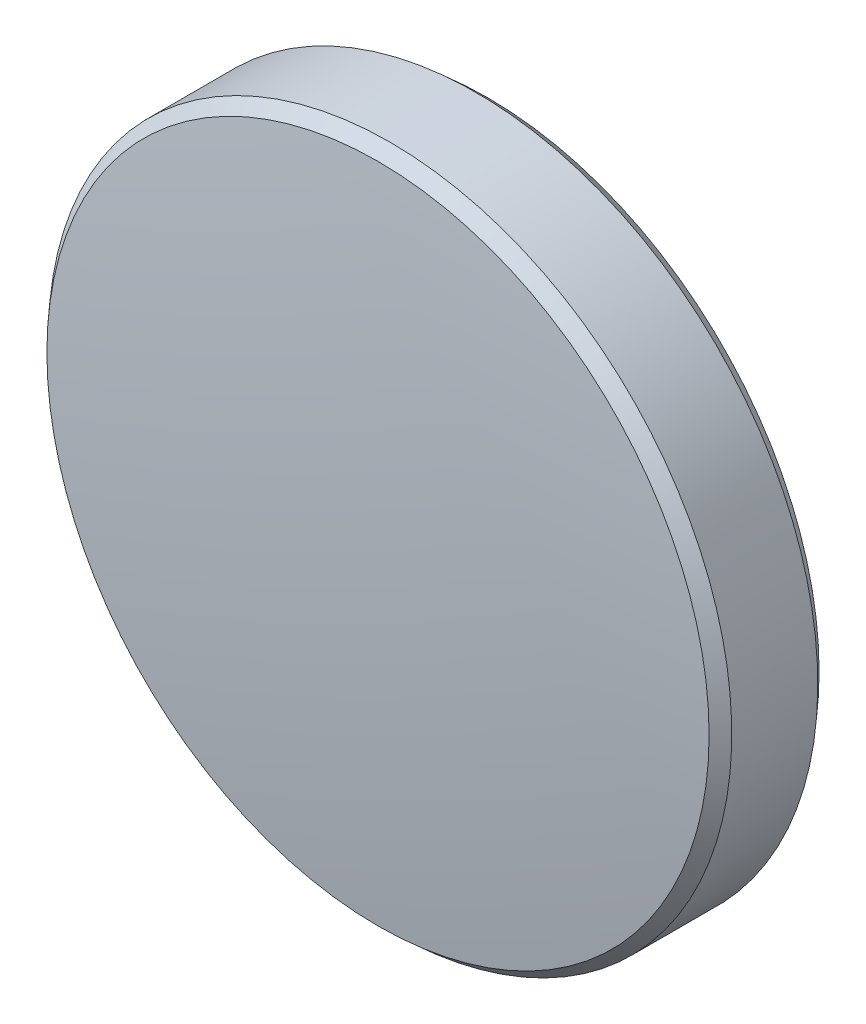
ISO-10303-21;
HEADER;
FILE_DESCRIPTION(('STEP AP214'),'2;1');
FILE_NAME('part.step','',(''),(''),'','','');
FILE_SCHEMA(('AUTOMOTIVE_DESIGN { 1 0 10303 214 1 1 1 1 }'));
ENDSEC;
DATA;
#1=APPLICATION_CONTEXT('core data for automotive mechanical design processes');
#2=APPLICATION_PROTOCOL_DEFINITION('international standard','automotive_design',2000,#1);
#3=PRODUCT_CONTEXT('',#1,'mechanical');
#4=PRODUCT('Part','Part','',(#3));
#5=PRODUCT_RELATED_PRODUCT_CATEGORY('part','',(#4));
#6=PRODUCT_DEFINITION_FORMATION('','',#4);
#7=PRODUCT_DEFINITION_CONTEXT('part definition',#1,'design');
#8=PRODUCT_DEFINITION('design','',#6,#7);
#9=PRODUCT_DEFINITION_SHAPE('','',#8);
#10=(LENGTH_UNIT() NAMED_UNIT(*) SI_UNIT(.MILLI.,.METRE.));
#11=(NAMED_UNIT(*) PLANE_ANGLE_UNIT() SI_UNIT($,.RADIAN.));
#12=(NAMED_UNIT(*) SI_UNIT($,.STERADIAN.) SOLID_ANGLE_UNIT());
#13=UNCERTAINTY_MEASURE_WITH_UNIT(LENGTH_MEASURE(1.E-05),#10,'distance_accuracy_value','');
#14=(GEOMETRIC_REPRESENTATION_CONTEXT(3) GLOBAL_UNCERTAINTY_ASSIGNED_CONTEXT((#13)) GLOBAL_UNIT_ASSIGNED_CONTEXT((#10,
#11,#12)) REPRESENTATION_CONTEXT('',''));
#15=CARTESIAN_POINT('',(0.,0.,0.));
#16=DIRECTION('',(0.,0.,1.));
#17=DIRECTION('',(1.,0.,0.));
#18=AXIS2_PLACEMENT_3D('',#15,#16,#17);
#19=CARTESIAN_POINT('',(0.,0.,-53.932));
#20=DIRECTION('',(0.,0.,1.));
#21=DIRECTION('',(0.,1.,0.));
#22=AXIS2_PLACEMENT_3D('',#19,#20,#21);
#23=SPHERICAL_SURFACE('',#22,55.297);
#24=CARTESIAN_POINT('',(0.,0.,1.02175329892499));
#25=DIRECTION('',(0.,0.,-1.));
#26=DIRECTION('',(0.,1.,0.));
#27=AXIS2_PLACEMENT_3D('',#24,#25,#26);
#28=CIRCLE('',#27,6.15168329491119);
#29=CARTESIAN_POINT('',(0.,6.15168329491118,1.02175329892499));
#30=VERTEX_POINT('',#29);
#31=EDGE_CURVE('E9',#30,#30,#28,.F.);
#32=ORIENTED_EDGE('',*,*,#31,.T.);
#33=EDGE_LOOP('',(#32));
#34=FACE_BOUND('',#33,.T.);
#35=ADVANCED_FACE('F13',(#34),#23,.T.);
#36=CARTESIAN_POINT('',(0.,0.,1.365));
#37=DIRECTION('',(0.,0.,1.));
#38=DIRECTION('',(0.,-1.,0.));
#39=AXIS2_PLACEMENT_3D('',#36,#37,#38);
#40=CYLINDRICAL_SURFACE('',#39,6.35);
#41=CARTESIAN_POINT('',(0.,0.,-0.79919067524388));
#42=DIRECTION('',(0.,0.,1.));
#43=DIRECTION('',(0.,-1.,0.));
#44=AXIS2_PLACEMENT_3D('',#41,#42,#43);
#45=CIRCLE('',#44,6.35);
#46=CARTESIAN_POINT('',(0.,-6.35,-0.799190675243881));
#47=VERTEX_POINT('',#46);
#48=EDGE_CURVE('E24',#47,#47,#45,.T.);
#49=ORIENTED_EDGE('',*,*,#48,.T.);
#50=EDGE_LOOP('',(#49));
#51=FACE_BOUND('',#50,.T.);
#52=CARTESIAN_POINT('',(0.,0.,0.79919067524388));
#53=DIRECTION('',(0.,0.,-1.));
#54=DIRECTION('',(0.,1.,0.));
#55=AXIS2_PLACEMENT_3D('',#52,#53,#54);
#56=CIRCLE('',#55,6.35);
#57=CARTESIAN_POINT('',(0.,6.35,0.799190675243881));
#58=VERTEX_POINT('',#57);
#59=EDGE_CURVE('E28',#58,#58,#56,.T.);
#60=ORIENTED_EDGE('',*,*,#59,.T.);
#61=EDGE_LOOP('',(#60));
#62=FACE_BOUND('',#61,.T.);
#63=ADVANCED_FACE('F34',(#51,#62),#40,.T.);
#64=CARTESIAN_POINT('',(0.,0.,53.932));
#65=DIRECTION('',(0.,0.,1.));
#66=DIRECTION('',(0.,-1.,0.));
#67=AXIS2_PLACEMENT_3D('',#64,#65,#66);
#68=SPHERICAL_SURFACE('',#67,55.297);
#69=CARTESIAN_POINT('',(0.,0.,-1.021753298925));
#70=DIRECTION('',(0.,0.,1.));
#71=DIRECTION('',(0.,-1.,0.));
#72=AXIS2_PLACEMENT_3D('',#69,#70,#71);
#73=CIRCLE('',#72,6.1516832949112);
#74=CARTESIAN_POINT('',(0.,-6.15168329491119,-1.021753298925));
#75=VERTEX_POINT('',#74);
#76=EDGE_CURVE('E20',#75,#75,#73,.F.);
#77=ORIENTED_EDGE('',*,*,#76,.T.);
#78=EDGE_LOOP('',(#77));
#79=FACE_BOUND('',#78,.T.);
#80=ADVANCED_FACE('F43',(#79),#68,.T.);
#81=CARTESIAN_POINT('',(0.,0.,-0.79919067524388));
#82=DIRECTION('',(0.,0.,1.));
#83=DIRECTION('',(0.,-1.,0.));
#84=AXIS2_PLACEMENT_3D('',#81,#82,#83);
#85=CONICAL_SURFACE('',#84,6.35,0.727853995893802);
#86=ORIENTED_EDGE('',*,*,#76,.F.);
#87=EDGE_LOOP('',(#86));
#88=FACE_BOUND('',#87,.T.);
#89=ORIENTED_EDGE('',*,*,#48,.F.);
#90=EDGE_LOOP('',(#89));
#91=FACE_BOUND('',#90,.T.);
#92=ADVANCED_FACE('F38',(#88,#91),#85,.T.);
#93=CARTESIAN_POINT('',(0.,0.,1.021753298925));
#94=DIRECTION('',(0.,0.,-1.));
#95=DIRECTION('',(0.,1.,0.));
#96=AXIS2_PLACEMENT_3D('',#93,#94,#95);
#97=CONICAL_SURFACE('',#96,6.15168329491119,0.727853995893823);
#98=ORIENTED_EDGE('',*,*,#59,.F.);
#99=EDGE_LOOP('',(#98));
#100=FACE_BOUND('',#99,.T.);
#101=ORIENTED_EDGE('',*,*,#31,.F.);
#102=EDGE_LOOP('',(#101));
#103=FACE_BOUND('',#102,.T.);
#104=ADVANCED_FACE('F15',(#100,#103),#97,.T.);
#105=CLOSED_SHELL('',(#35,#63,#80,#92,#104));
#106=MANIFOLD_SOLID_BREP('B1',#105);
#107=ADVANCED_BREP_SHAPE_REPRESENTATION('',(#18,#106),#14);
#108=SHAPE_DEFINITION_REPRESENTATION(#9,#107);
ENDSEC;
END-ISO-10303-21;
